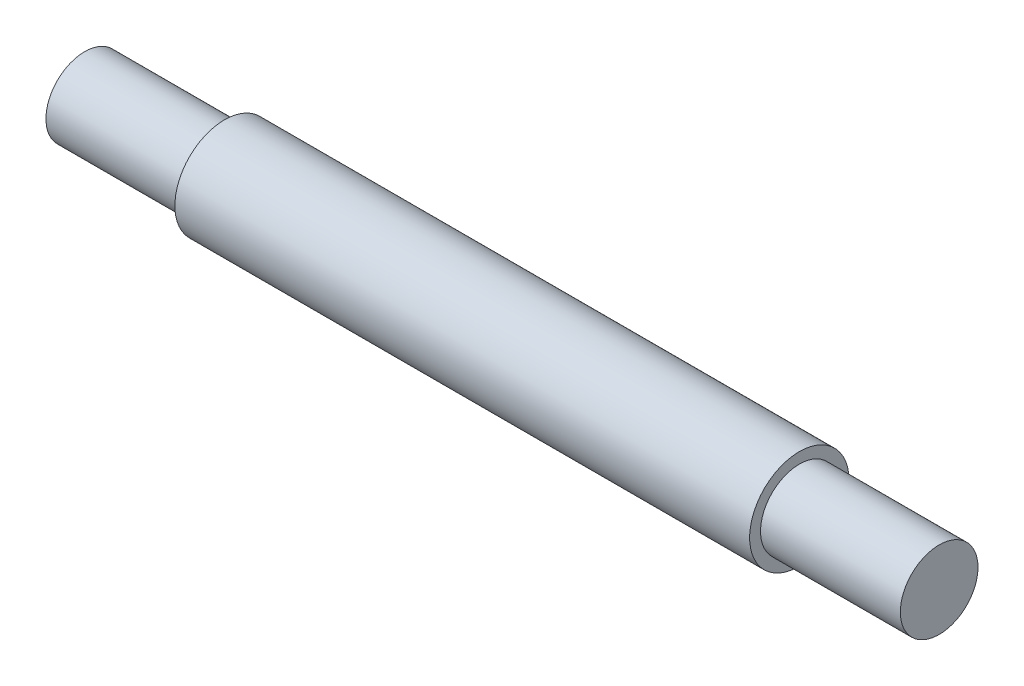
ISO-10303-21;
HEADER;
FILE_DESCRIPTION(('STEP AP214'),'2;1');
FILE_NAME('part.step','',(''),(''),'','','');
FILE_SCHEMA(('AUTOMOTIVE_DESIGN { 1 0 10303 214 1 1 1 1 }'));
ENDSEC;
DATA;
#1=APPLICATION_CONTEXT('core data for automotive mechanical design processes');
#2=APPLICATION_PROTOCOL_DEFINITION('international standard','automotive_design',2000,#1);
#3=PRODUCT_CONTEXT('',#1,'mechanical');
#4=PRODUCT('Part','Part','',(#3));
#5=PRODUCT_RELATED_PRODUCT_CATEGORY('part','',(#4));
#6=PRODUCT_DEFINITION_FORMATION('','',#4);
#7=PRODUCT_DEFINITION_CONTEXT('part definition',#1,'design');
#8=PRODUCT_DEFINITION('design','',#6,#7);
#9=PRODUCT_DEFINITION_SHAPE('','',#8);
#10=(LENGTH_UNIT() NAMED_UNIT(*) SI_UNIT(.MILLI.,.METRE.));
#11=(NAMED_UNIT(*) PLANE_ANGLE_UNIT() SI_UNIT($,.RADIAN.));
#12=(NAMED_UNIT(*) SI_UNIT($,.STERADIAN.) SOLID_ANGLE_UNIT());
#13=UNCERTAINTY_MEASURE_WITH_UNIT(LENGTH_MEASURE(1.E-05),#10,'distance_accuracy_value','');
#14=(GEOMETRIC_REPRESENTATION_CONTEXT(3) GLOBAL_UNCERTAINTY_ASSIGNED_CONTEXT((#13)) GLOBAL_UNIT_ASSIGNED_CONTEXT((#10,
#11,#12)) REPRESENTATION_CONTEXT('',''));
#15=CARTESIAN_POINT('',(0.,0.,0.));
#16=DIRECTION('',(0.,0.,1.));
#17=DIRECTION('',(1.,0.,0.));
#18=AXIS2_PLACEMENT_3D('',#15,#16,#17);
#19=CARTESIAN_POINT('',(34.925,0.,0.));
#20=DIRECTION('',(-1.,0.,0.));
#21=DIRECTION('',(0.,0.,1.));
#22=AXIS2_PLACEMENT_3D('',#19,#20,#21);
#23=CYLINDRICAL_SURFACE('',#22,3.175);
#24=CARTESIAN_POINT('',(23.495,0.,0.));
#25=DIRECTION('',(1.,0.,0.));
#26=DIRECTION('',(0.,0.,-1.));
#27=AXIS2_PLACEMENT_3D('',#24,#25,#26);
#28=CIRCLE('',#27,3.175);
#29=CARTESIAN_POINT('',(23.495,0.,-3.175));
#30=VERTEX_POINT('',#29);
#31=EDGE_CURVE('E33',#30,#30,#28,.T.);
#32=ORIENTED_EDGE('',*,*,#31,.T.);
#33=EDGE_LOOP('',(#32));
#34=FACE_BOUND('',#33,.T.);
#35=CARTESIAN_POINT('',(34.925,0.,0.));
#36=DIRECTION('',(1.,0.,0.));
#37=DIRECTION('',(0.,0.,-1.));
#38=AXIS2_PLACEMENT_3D('',#35,#36,#37);
#39=CIRCLE('',#38,3.175);
#40=CARTESIAN_POINT('',(34.925,0.,-3.175));
#41=VERTEX_POINT('',#40);
#42=EDGE_CURVE('E37',#41,#41,#39,.T.);
#43=ORIENTED_EDGE('',*,*,#42,.F.);
#44=EDGE_LOOP('',(#43));
#45=FACE_BOUND('',#44,.T.);
#46=ADVANCED_FACE('F30',(#34,#45),#23,.T.);
#47=CARTESIAN_POINT('',(34.925,0.,0.));
#48=DIRECTION('',(1.,0.,0.));
#49=DIRECTION('',(0.,0.,-1.));
#50=AXIS2_PLACEMENT_3D('',#47,#48,#49);
#51=PLANE('',#50);
#52=ORIENTED_EDGE('',*,*,#42,.T.);
#53=EDGE_LOOP('',(#52));
#54=FACE_BOUND('',#53,.T.);
#55=ADVANCED_FACE('F61',(#54),#51,.T.);
#56=CARTESIAN_POINT('',(23.495,0.,0.));
#57=DIRECTION('',(1.,0.,0.));
#58=DIRECTION('',(0.,0.,-1.));
#59=AXIS2_PLACEMENT_3D('',#56,#57,#58);
#60=PLANE('',#59);
#61=CARTESIAN_POINT('',(23.495,0.,0.));
#62=DIRECTION('',(1.,0.,0.));
#63=DIRECTION('',(0.,0.,-1.));
#64=AXIS2_PLACEMENT_3D('',#61,#62,#63);
#65=CIRCLE('',#64,4.064);
#66=CARTESIAN_POINT('',(23.495,0.,-4.064));
#67=VERTEX_POINT('',#66);
#68=EDGE_CURVE('E49',#67,#67,#65,.T.);
#69=ORIENTED_EDGE('',*,*,#68,.T.);
#70=EDGE_LOOP('',(#69));
#71=FACE_BOUND('',#70,.T.);
#72=ORIENTED_EDGE('',*,*,#31,.F.);
#73=EDGE_LOOP('',(#72));
#74=FACE_BOUND('',#73,.T.);
#75=ADVANCED_FACE('F58',(#71,#74),#60,.T.);
#76=CARTESIAN_POINT('',(-23.495,0.,0.));
#77=DIRECTION('',(1.,0.,0.));
#78=DIRECTION('',(0.,0.,-1.));
#79=AXIS2_PLACEMENT_3D('',#76,#77,#78);
#80=PLANE('',#79);
#81=CARTESIAN_POINT('',(-23.495,0.,0.));
#82=DIRECTION('',(1.,0.,0.));
#83=DIRECTION('',(0.,0.,-1.));
#84=AXIS2_PLACEMENT_3D('',#81,#82,#83);
#85=CIRCLE('',#84,4.064);
#86=CARTESIAN_POINT('',(-23.495,0.,-4.064));
#87=VERTEX_POINT('',#86);
#88=EDGE_CURVE('E46',#87,#87,#85,.T.);
#89=ORIENTED_EDGE('',*,*,#88,.F.);
#90=EDGE_LOOP('',(#89));
#91=FACE_BOUND('',#90,.T.);
#92=CARTESIAN_POINT('',(-23.495,0.,0.));
#93=DIRECTION('',(1.,0.,0.));
#94=DIRECTION('',(0.,0.,-1.));
#95=AXIS2_PLACEMENT_3D('',#92,#93,#94);
#96=CIRCLE('',#95,3.175);
#97=CARTESIAN_POINT('',(-23.495,0.,-3.175));
#98=VERTEX_POINT('',#97);
#99=EDGE_CURVE('E10',#98,#98,#96,.T.);
#100=ORIENTED_EDGE('',*,*,#99,.T.);
#101=EDGE_LOOP('',(#100));
#102=FACE_BOUND('',#101,.T.);
#103=ADVANCED_FACE('F60',(#91,#102),#80,.F.);
#104=CARTESIAN_POINT('',(23.495,0.,0.));
#105=DIRECTION('',(-1.,0.,0.));
#106=DIRECTION('',(0.,0.,1.));
#107=AXIS2_PLACEMENT_3D('',#104,#105,#106);
#108=CYLINDRICAL_SURFACE('',#107,4.064);
#109=ORIENTED_EDGE('',*,*,#68,.F.);
#110=EDGE_LOOP('',(#109));
#111=FACE_BOUND('',#110,.T.);
#112=ORIENTED_EDGE('',*,*,#88,.T.);
#113=EDGE_LOOP('',(#112));
#114=FACE_BOUND('',#113,.T.);
#115=ADVANCED_FACE('F67',(#111,#114),#108,.T.);
#116=CARTESIAN_POINT('',(-34.925,0.,0.));
#117=DIRECTION('',(1.,0.,0.));
#118=DIRECTION('',(0.,0.,-1.));
#119=AXIS2_PLACEMENT_3D('',#116,#117,#118);
#120=PLANE('',#119);
#121=CARTESIAN_POINT('',(-34.925,0.,0.));
#122=DIRECTION('',(1.,0.,0.));
#123=DIRECTION('',(0.,0.,-1.));
#124=AXIS2_PLACEMENT_3D('',#121,#122,#123);
#125=CIRCLE('',#124,3.175);
#126=CARTESIAN_POINT('',(-34.925,0.,-3.175));
#127=VERTEX_POINT('',#126);
#128=EDGE_CURVE('E41',#127,#127,#125,.T.);
#129=ORIENTED_EDGE('',*,*,#128,.F.);
#130=EDGE_LOOP('',(#129));
#131=FACE_BOUND('',#130,.T.);
#132=ADVANCED_FACE('F77',(#131),#120,.F.);
#133=ORIENTED_EDGE('',*,*,#128,.T.);
#134=EDGE_LOOP('',(#133));
#135=FACE_BOUND('',#134,.T.);
#136=ORIENTED_EDGE('',*,*,#99,.F.);
#137=EDGE_LOOP('',(#136));
#138=FACE_BOUND('',#137,.T.);
#139=ADVANCED_FACE('F73',(#135,#138),#23,.T.);
#140=CLOSED_SHELL('',(#46,#55,#75,#103,#115,#132,#139));
#141=MANIFOLD_SOLID_BREP('B2',#140);
#142=ADVANCED_BREP_SHAPE_REPRESENTATION('',(#18,#141),#14);
#143=SHAPE_DEFINITION_REPRESENTATION(#9,#142);
ENDSEC;
END-ISO-10303-21;
